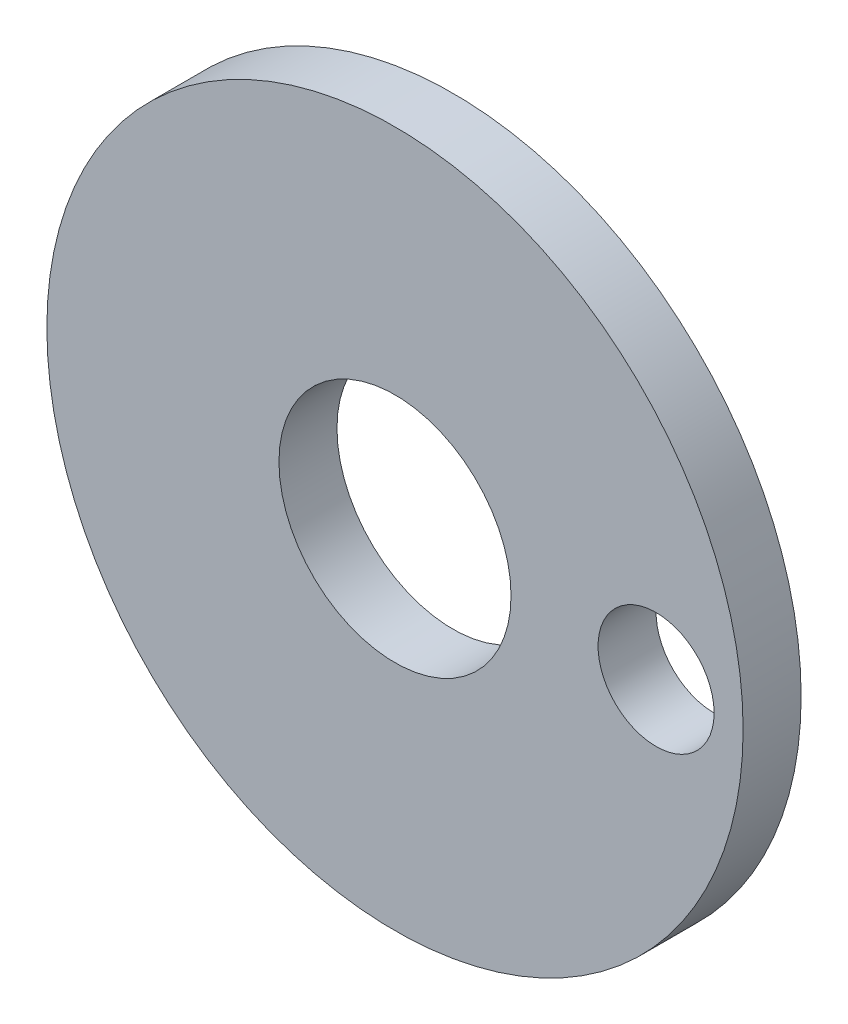
ISO-10303-21;
HEADER;
FILE_DESCRIPTION(('STEP AP214'),'2;1');
FILE_NAME('part.step','',(''),(''),'','','');
FILE_SCHEMA(('AUTOMOTIVE_DESIGN { 1 0 10303 214 1 1 1 1 }'));
ENDSEC;
DATA;
#1=APPLICATION_CONTEXT('core data for automotive mechanical design processes');
#2=APPLICATION_PROTOCOL_DEFINITION('international standard','automotive_design',2000,#1);
#3=PRODUCT_CONTEXT('',#1,'mechanical');
#4=PRODUCT('Part','Part','',(#3));
#5=PRODUCT_RELATED_PRODUCT_CATEGORY('part','',(#4));
#6=PRODUCT_DEFINITION_FORMATION('','',#4);
#7=PRODUCT_DEFINITION_CONTEXT('part definition',#1,'design');
#8=PRODUCT_DEFINITION('design','',#6,#7);
#9=PRODUCT_DEFINITION_SHAPE('','',#8);
#10=(LENGTH_UNIT() NAMED_UNIT(*) SI_UNIT(.MILLI.,.METRE.));
#11=(NAMED_UNIT(*) PLANE_ANGLE_UNIT() SI_UNIT($,.RADIAN.));
#12=(NAMED_UNIT(*) SI_UNIT($,.STERADIAN.) SOLID_ANGLE_UNIT());
#13=UNCERTAINTY_MEASURE_WITH_UNIT(LENGTH_MEASURE(1.E-05),#10,'distance_accuracy_value','');
#14=(GEOMETRIC_REPRESENTATION_CONTEXT(3) GLOBAL_UNCERTAINTY_ASSIGNED_CONTEXT((#13)) GLOBAL_UNIT_ASSIGNED_CONTEXT((#10,
#11,#12)) REPRESENTATION_CONTEXT('',''));
#15=CARTESIAN_POINT('',(0.,0.,0.));
#16=DIRECTION('',(0.,0.,1.));
#17=DIRECTION('',(1.,0.,0.));
#18=AXIS2_PLACEMENT_3D('',#15,#16,#17);
#19=CARTESIAN_POINT('',(0.,0.,1.));
#20=DIRECTION('',(0.,0.,1.));
#21=DIRECTION('',(1.,0.,0.));
#22=AXIS2_PLACEMENT_3D('',#19,#20,#21);
#23=PLANE('',#22);
#24=CARTESIAN_POINT('',(0.,0.,1.));
#25=DIRECTION('',(0.,0.,1.));
#26=DIRECTION('',(1.,0.,0.));
#27=AXIS2_PLACEMENT_3D('',#24,#25,#26);
#28=CIRCLE('',#27,2.);
#29=CARTESIAN_POINT('',(2.,0.,1.));
#30=VERTEX_POINT('',#29);
#31=EDGE_CURVE('E50',#30,#30,#28,.T.);
#32=ORIENTED_EDGE('',*,*,#31,.F.);
#33=EDGE_LOOP('',(#32));
#34=FACE_BOUND('',#33,.T.);
#35=CARTESIAN_POINT('',(0.,0.,1.));
#36=DIRECTION('',(0.,0.,1.));
#37=DIRECTION('',(1.,0.,0.));
#38=AXIS2_PLACEMENT_3D('',#35,#36,#37);
#39=CIRCLE('',#38,6.);
#40=CARTESIAN_POINT('',(6.,0.,1.));
#41=VERTEX_POINT('',#40);
#42=EDGE_CURVE('E10',#41,#41,#39,.T.);
#43=ORIENTED_EDGE('',*,*,#42,.T.);
#44=EDGE_LOOP('',(#43));
#45=FACE_BOUND('',#44,.T.);
#46=CARTESIAN_POINT('',(4.5,0.,1.));
#47=DIRECTION('',(0.,0.,1.));
#48=DIRECTION('',(1.,0.,0.));
#49=AXIS2_PLACEMENT_3D('',#46,#47,#48);
#50=CIRCLE('',#49,1.);
#51=CARTESIAN_POINT('',(5.5,0.,1.));
#52=VERTEX_POINT('',#51);
#53=EDGE_CURVE('E55',#52,#52,#50,.T.);
#54=ORIENTED_EDGE('',*,*,#53,.F.);
#55=EDGE_LOOP('',(#54));
#56=FACE_BOUND('',#55,.T.);
#57=ADVANCED_FACE('F39',(#34,#45,#56),#23,.T.);
#58=CARTESIAN_POINT('',(0.,0.,0.));
#59=DIRECTION('',(0.,0.,1.));
#60=DIRECTION('',(1.,0.,0.));
#61=AXIS2_PLACEMENT_3D('',#58,#59,#60);
#62=PLANE('',#61);
#63=CARTESIAN_POINT('',(0.,0.,0.));
#64=DIRECTION('',(0.,0.,1.));
#65=DIRECTION('',(1.,0.,0.));
#66=AXIS2_PLACEMENT_3D('',#63,#64,#65);
#67=CIRCLE('',#66,6.);
#68=CARTESIAN_POINT('',(6.,0.,0.));
#69=VERTEX_POINT('',#68);
#70=EDGE_CURVE('E43',#69,#69,#67,.T.);
#71=ORIENTED_EDGE('',*,*,#70,.F.);
#72=EDGE_LOOP('',(#71));
#73=FACE_BOUND('',#72,.T.);
#74=CARTESIAN_POINT('',(0.,0.,0.));
#75=DIRECTION('',(0.,0.,1.));
#76=DIRECTION('',(1.,0.,0.));
#77=AXIS2_PLACEMENT_3D('',#74,#75,#76);
#78=CIRCLE('',#77,2.);
#79=CARTESIAN_POINT('',(2.,0.,0.));
#80=VERTEX_POINT('',#79);
#81=EDGE_CURVE('E52',#80,#80,#78,.T.);
#82=ORIENTED_EDGE('',*,*,#81,.T.);
#83=EDGE_LOOP('',(#82));
#84=FACE_BOUND('',#83,.T.);
#85=CARTESIAN_POINT('',(4.5,0.,0.));
#86=DIRECTION('',(0.,0.,1.));
#87=DIRECTION('',(1.,0.,0.));
#88=AXIS2_PLACEMENT_3D('',#85,#86,#87);
#89=CIRCLE('',#88,1.);
#90=CARTESIAN_POINT('',(5.5,0.,0.));
#91=VERTEX_POINT('',#90);
#92=EDGE_CURVE('E58',#91,#91,#89,.T.);
#93=ORIENTED_EDGE('',*,*,#92,.T.);
#94=EDGE_LOOP('',(#93));
#95=FACE_BOUND('',#94,.T.);
#96=ADVANCED_FACE('F68',(#73,#84,#95),#62,.F.);
#97=CARTESIAN_POINT('',(0.,0.,1.));
#98=DIRECTION('',(0.,0.,-1.));
#99=DIRECTION('',(-1.,0.,0.));
#100=AXIS2_PLACEMENT_3D('',#97,#98,#99);
#101=CYLINDRICAL_SURFACE('',#100,6.);
#102=ORIENTED_EDGE('',*,*,#42,.F.);
#103=EDGE_LOOP('',(#102));
#104=FACE_BOUND('',#103,.T.);
#105=ORIENTED_EDGE('',*,*,#70,.T.);
#106=EDGE_LOOP('',(#105));
#107=FACE_BOUND('',#106,.T.);
#108=ADVANCED_FACE('F41',(#104,#107),#101,.T.);
#109=CARTESIAN_POINT('',(0.,0.,1.));
#110=DIRECTION('',(0.,0.,-1.));
#111=DIRECTION('',(-1.,0.,0.));
#112=AXIS2_PLACEMENT_3D('',#109,#110,#111);
#113=CYLINDRICAL_SURFACE('',#112,2.);
#114=ORIENTED_EDGE('',*,*,#31,.T.);
#115=EDGE_LOOP('',(#114));
#116=FACE_BOUND('',#115,.T.);
#117=ORIENTED_EDGE('',*,*,#81,.F.);
#118=EDGE_LOOP('',(#117));
#119=FACE_BOUND('',#118,.T.);
#120=ADVANCED_FACE('F77',(#116,#119),#113,.F.);
#121=CARTESIAN_POINT('',(4.5,0.,1.));
#122=DIRECTION('',(0.,0.,-1.));
#123=DIRECTION('',(-1.,0.,0.));
#124=AXIS2_PLACEMENT_3D('',#121,#122,#123);
#125=CYLINDRICAL_SURFACE('',#124,1.);
#126=ORIENTED_EDGE('',*,*,#53,.T.);
#127=EDGE_LOOP('',(#126));
#128=FACE_BOUND('',#127,.T.);
#129=ORIENTED_EDGE('',*,*,#92,.F.);
#130=EDGE_LOOP('',(#129));
#131=FACE_BOUND('',#130,.T.);
#132=ADVANCED_FACE('F64',(#128,#131),#125,.F.);
#133=CLOSED_SHELL('',(#57,#96,#108,#120,#132));
#134=MANIFOLD_SOLID_BREP('B2',#133);
#135=ADVANCED_BREP_SHAPE_REPRESENTATION('',(#18,#134),#14);
#136=SHAPE_DEFINITION_REPRESENTATION(#9,#135);
ENDSEC;
END-ISO-10303-21;
